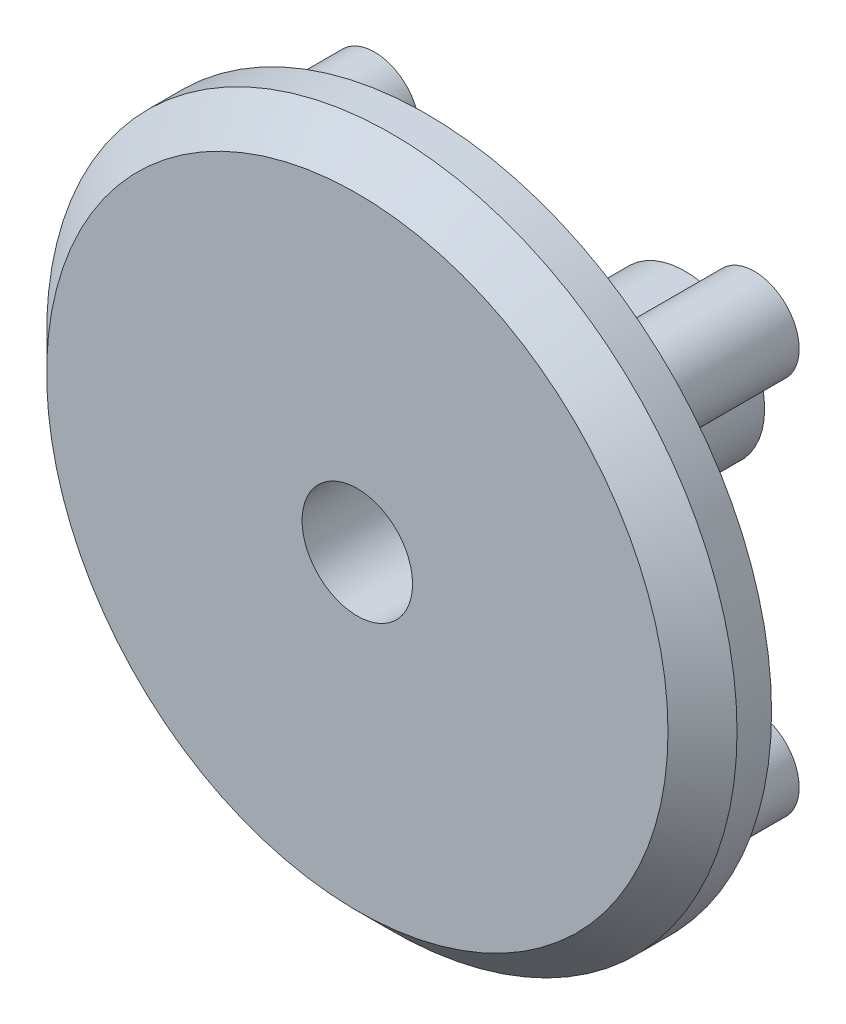
ISO-10303-21;
HEADER;
FILE_DESCRIPTION(('STEP AP214'),'2;1');
FILE_NAME('part.step','',(''),(''),'','','');
FILE_SCHEMA(('AUTOMOTIVE_DESIGN { 1 0 10303 214 1 1 1 1 }'));
ENDSEC;
DATA;
#1=APPLICATION_CONTEXT('core data for automotive mechanical design processes');
#2=APPLICATION_PROTOCOL_DEFINITION('international standard','automotive_design',2000,#1);
#3=PRODUCT_CONTEXT('',#1,'mechanical');
#4=PRODUCT('Part','Part','',(#3));
#5=PRODUCT_RELATED_PRODUCT_CATEGORY('part','',(#4));
#6=PRODUCT_DEFINITION_FORMATION('','',#4);
#7=PRODUCT_DEFINITION_CONTEXT('part definition',#1,'design');
#8=PRODUCT_DEFINITION('design','',#6,#7);
#9=PRODUCT_DEFINITION_SHAPE('','',#8);
#10=(LENGTH_UNIT() NAMED_UNIT(*) SI_UNIT(.MILLI.,.METRE.));
#11=(NAMED_UNIT(*) PLANE_ANGLE_UNIT() SI_UNIT($,.RADIAN.));
#12=(NAMED_UNIT(*) SI_UNIT($,.STERADIAN.) SOLID_ANGLE_UNIT());
#13=UNCERTAINTY_MEASURE_WITH_UNIT(LENGTH_MEASURE(1.E-05),#10,'distance_accuracy_value','');
#14=(GEOMETRIC_REPRESENTATION_CONTEXT(3) GLOBAL_UNCERTAINTY_ASSIGNED_CONTEXT((#13)) GLOBAL_UNIT_ASSIGNED_CONTEXT((#10,
#11,#12)) REPRESENTATION_CONTEXT('',''));
#15=CARTESIAN_POINT('',(0.,0.,0.));
#16=DIRECTION('',(0.,0.,1.));
#17=DIRECTION('',(1.,0.,0.));
#18=AXIS2_PLACEMENT_3D('',#15,#16,#17);
#19=CARTESIAN_POINT('',(0.,0.,2.));
#20=DIRECTION('',(0.,0.,1.));
#21=DIRECTION('',(1.,0.,0.));
#22=AXIS2_PLACEMENT_3D('',#19,#20,#21);
#23=PLANE('',#22);
#24=CARTESIAN_POINT('',(0.,0.,2.));
#25=DIRECTION('',(0.,0.,1.));
#26=DIRECTION('',(1.,0.,0.));
#27=AXIS2_PLACEMENT_3D('',#24,#25,#26);
#28=CIRCLE('',#27,9.00000000000001);
#29=CARTESIAN_POINT('',(9.00000000000001,0.,2.));
#30=VERTEX_POINT('',#29);
#31=EDGE_CURVE('E59',#30,#30,#28,.T.);
#32=ORIENTED_EDGE('',*,*,#31,.T.);
#33=EDGE_LOOP('',(#32));
#34=FACE_BOUND('',#33,.T.);
#35=CARTESIAN_POINT('',(0.,0.,2.));
#36=DIRECTION('',(0.,0.,1.));
#37=DIRECTION('',(1.,0.,0.));
#38=AXIS2_PLACEMENT_3D('',#35,#36,#37);
#39=CIRCLE('',#38,1.6);
#40=CARTESIAN_POINT('',(1.6,0.,2.));
#41=VERTEX_POINT('',#40);
#42=EDGE_CURVE('E67',#41,#41,#39,.T.);
#43=ORIENTED_EDGE('',*,*,#42,.F.);
#44=EDGE_LOOP('',(#43));
#45=FACE_BOUND('',#44,.T.);
#46=ADVANCED_FACE('F51',(#34,#45),#23,.T.);
#47=CARTESIAN_POINT('',(0.,0.,0.));
#48=DIRECTION('',(0.,0.,1.));
#49=DIRECTION('',(1.,0.,0.));
#50=AXIS2_PLACEMENT_3D('',#47,#48,#49);
#51=PLANE('',#50);
#52=CARTESIAN_POINT('',(0.,0.,0.));
#53=DIRECTION('',(0.,0.,1.));
#54=DIRECTION('',(1.,0.,0.));
#55=AXIS2_PLACEMENT_3D('',#52,#53,#54);
#56=CIRCLE('',#55,2.3);
#57=CARTESIAN_POINT('',(2.3,0.,0.));
#58=VERTEX_POINT('',#57);
#59=EDGE_CURVE('E97',#58,#58,#56,.T.);
#60=ORIENTED_EDGE('',*,*,#59,.T.);
#61=EDGE_LOOP('',(#60));
#62=FACE_BOUND('',#61,.T.);
#63=CARTESIAN_POINT('',(-5.5,-5.5,0.));
#64=DIRECTION('',(0.,0.,1.));
#65=DIRECTION('',(1.,0.,0.));
#66=AXIS2_PLACEMENT_3D('',#63,#64,#65);
#67=CIRCLE('',#66,1.3);
#68=CARTESIAN_POINT('',(-4.2,-5.5,0.));
#69=VERTEX_POINT('',#68);
#70=EDGE_CURVE('E91',#69,#69,#67,.T.);
#71=ORIENTED_EDGE('',*,*,#70,.T.);
#72=EDGE_LOOP('',(#71));
#73=FACE_BOUND('',#72,.T.);
#74=CARTESIAN_POINT('',(5.5,-5.5,0.));
#75=DIRECTION('',(0.,0.,1.));
#76=DIRECTION('',(1.,0.,0.));
#77=AXIS2_PLACEMENT_3D('',#74,#75,#76);
#78=CIRCLE('',#77,1.3);
#79=CARTESIAN_POINT('',(6.8,-5.5,0.));
#80=VERTEX_POINT('',#79);
#81=EDGE_CURVE('E85',#80,#80,#78,.T.);
#82=ORIENTED_EDGE('',*,*,#81,.T.);
#83=EDGE_LOOP('',(#82));
#84=FACE_BOUND('',#83,.T.);
#85=CARTESIAN_POINT('',(5.5,5.5,0.));
#86=DIRECTION('',(0.,0.,1.));
#87=DIRECTION('',(1.,0.,0.));
#88=AXIS2_PLACEMENT_3D('',#85,#86,#87);
#89=CIRCLE('',#88,1.3);
#90=CARTESIAN_POINT('',(6.8,5.5,0.));
#91=VERTEX_POINT('',#90);
#92=EDGE_CURVE('E79',#91,#91,#89,.T.);
#93=ORIENTED_EDGE('',*,*,#92,.T.);
#94=EDGE_LOOP('',(#93));
#95=FACE_BOUND('',#94,.T.);
#96=CARTESIAN_POINT('',(-5.5,5.5,0.));
#97=DIRECTION('',(0.,0.,1.));
#98=DIRECTION('',(1.,0.,0.));
#99=AXIS2_PLACEMENT_3D('',#96,#97,#98);
#100=CIRCLE('',#99,1.3);
#101=CARTESIAN_POINT('',(-4.2,5.5,0.));
#102=VERTEX_POINT('',#101);
#103=EDGE_CURVE('E73',#102,#102,#100,.T.);
#104=ORIENTED_EDGE('',*,*,#103,.T.);
#105=EDGE_LOOP('',(#104));
#106=FACE_BOUND('',#105,.T.);
#107=CARTESIAN_POINT('',(0.,0.,0.));
#108=DIRECTION('',(0.,0.,1.));
#109=DIRECTION('',(1.,0.,0.));
#110=AXIS2_PLACEMENT_3D('',#107,#108,#109);
#111=CIRCLE('',#110,10.);
#112=CARTESIAN_POINT('',(9.99999999999999,0.,0.));
#113=VERTEX_POINT('',#112);
#114=EDGE_CURVE('E63',#113,#113,#111,.T.);
#115=ORIENTED_EDGE('',*,*,#114,.F.);
#116=EDGE_LOOP('',(#115));
#117=FACE_BOUND('',#116,.T.);
#118=ADVANCED_FACE('F124',(#62,#73,#84,#95,#106,#117),#51,.F.);
#119=CARTESIAN_POINT('',(0.,0.,2.));
#120=DIRECTION('',(0.,0.,-1.));
#121=DIRECTION('',(-1.,0.,0.));
#122=AXIS2_PLACEMENT_3D('',#119,#120,#121);
#123=CYLINDRICAL_SURFACE('',#122,10.);
#124=CARTESIAN_POINT('',(0.,0.,1.));
#125=DIRECTION('',(0.,0.,1.));
#126=DIRECTION('',(1.,0.,0.));
#127=AXIS2_PLACEMENT_3D('',#124,#125,#126);
#128=CIRCLE('',#127,10.);
#129=CARTESIAN_POINT('',(9.99999999999999,0.,1.));
#130=VERTEX_POINT('',#129);
#131=EDGE_CURVE('E11',#130,#130,#128,.F.);
#132=ORIENTED_EDGE('',*,*,#131,.T.);
#133=EDGE_LOOP('',(#132));
#134=FACE_BOUND('',#133,.T.);
#135=ORIENTED_EDGE('',*,*,#114,.T.);
#136=EDGE_LOOP('',(#135));
#137=FACE_BOUND('',#136,.T.);
#138=ADVANCED_FACE('F112',(#134,#137),#123,.T.);
#139=CARTESIAN_POINT('',(0.,0.,2.));
#140=DIRECTION('',(0.,0.,-1.));
#141=DIRECTION('',(-1.,0.,0.));
#142=AXIS2_PLACEMENT_3D('',#139,#140,#141);
#143=CYLINDRICAL_SURFACE('',#142,1.6);
#144=ORIENTED_EDGE('',*,*,#42,.T.);
#145=EDGE_LOOP('',(#144));
#146=FACE_BOUND('',#145,.T.);
#147=CARTESIAN_POINT('',(0.,0.,-7.5));
#148=DIRECTION('',(0.,0.,1.));
#149=DIRECTION('',(1.,0.,0.));
#150=AXIS2_PLACEMENT_3D('',#147,#148,#149);
#151=CIRCLE('',#150,1.6);
#152=CARTESIAN_POINT('',(1.6,0.,-7.5));
#153=VERTEX_POINT('',#152);
#154=EDGE_CURVE('E100',#153,#153,#151,.T.);
#155=ORIENTED_EDGE('',*,*,#154,.F.);
#156=EDGE_LOOP('',(#155));
#157=FACE_BOUND('',#156,.T.);
#158=ADVANCED_FACE('F109',(#146,#157),#143,.F.);
#159=CARTESIAN_POINT('',(-5.5,5.5,-4.));
#160=DIRECTION('',(0.,0.,1.));
#161=DIRECTION('',(1.,0.,0.));
#162=AXIS2_PLACEMENT_3D('',#159,#160,#161);
#163=CYLINDRICAL_SURFACE('',#162,1.3);
#164=CARTESIAN_POINT('',(-5.5,5.5,-4.));
#165=DIRECTION('',(0.,0.,1.));
#166=DIRECTION('',(1.,0.,0.));
#167=AXIS2_PLACEMENT_3D('',#164,#165,#166);
#168=CIRCLE('',#167,1.3);
#169=CARTESIAN_POINT('',(-4.2,5.5,-4.));
#170=VERTEX_POINT('',#169);
#171=EDGE_CURVE('E72',#170,#170,#168,.T.);
#172=ORIENTED_EDGE('',*,*,#171,.T.);
#173=EDGE_LOOP('',(#172));
#174=FACE_BOUND('',#173,.T.);
#175=ORIENTED_EDGE('',*,*,#103,.F.);
#176=EDGE_LOOP('',(#175));
#177=FACE_BOUND('',#176,.T.);
#178=ADVANCED_FACE('F111',(#174,#177),#163,.T.);
#179=CARTESIAN_POINT('',(0.,0.,-4.));
#180=DIRECTION('',(0.,0.,1.));
#181=DIRECTION('',(1.,0.,0.));
#182=AXIS2_PLACEMENT_3D('',#179,#180,#181);
#183=PLANE('',#182);
#184=ORIENTED_EDGE('',*,*,#171,.F.);
#185=EDGE_LOOP('',(#184));
#186=FACE_BOUND('',#185,.T.);
#187=ADVANCED_FACE('F120',(#186),#183,.F.);
#188=CARTESIAN_POINT('',(5.5,5.5,-4.));
#189=DIRECTION('',(0.,0.,1.));
#190=DIRECTION('',(1.,0.,0.));
#191=AXIS2_PLACEMENT_3D('',#188,#189,#190);
#192=CYLINDRICAL_SURFACE('',#191,1.3);
#193=CARTESIAN_POINT('',(5.5,5.5,-4.));
#194=DIRECTION('',(0.,0.,1.));
#195=DIRECTION('',(1.,0.,0.));
#196=AXIS2_PLACEMENT_3D('',#193,#194,#195);
#197=CIRCLE('',#196,1.3);
#198=CARTESIAN_POINT('',(6.8,5.5,-4.));
#199=VERTEX_POINT('',#198);
#200=EDGE_CURVE('E76',#199,#199,#197,.T.);
#201=ORIENTED_EDGE('',*,*,#200,.T.);
#202=EDGE_LOOP('',(#201));
#203=FACE_BOUND('',#202,.T.);
#204=ORIENTED_EDGE('',*,*,#92,.F.);
#205=EDGE_LOOP('',(#204));
#206=FACE_BOUND('',#205,.T.);
#207=ADVANCED_FACE('F151',(#203,#206),#192,.T.);
#208=CARTESIAN_POINT('',(0.,0.,-4.));
#209=DIRECTION('',(0.,0.,1.));
#210=DIRECTION('',(1.,0.,0.));
#211=AXIS2_PLACEMENT_3D('',#208,#209,#210);
#212=PLANE('',#211);
#213=ORIENTED_EDGE('',*,*,#200,.F.);
#214=EDGE_LOOP('',(#213));
#215=FACE_BOUND('',#214,.T.);
#216=ADVANCED_FACE('F153',(#215),#212,.F.);
#217=CARTESIAN_POINT('',(5.5,-5.5,-4.));
#218=DIRECTION('',(0.,0.,1.));
#219=DIRECTION('',(1.,0.,0.));
#220=AXIS2_PLACEMENT_3D('',#217,#218,#219);
#221=CYLINDRICAL_SURFACE('',#220,1.3);
#222=CARTESIAN_POINT('',(5.5,-5.5,-4.));
#223=DIRECTION('',(0.,0.,1.));
#224=DIRECTION('',(1.,0.,0.));
#225=AXIS2_PLACEMENT_3D('',#222,#223,#224);
#226=CIRCLE('',#225,1.3);
#227=CARTESIAN_POINT('',(6.8,-5.5,-4.));
#228=VERTEX_POINT('',#227);
#229=EDGE_CURVE('E82',#228,#228,#226,.T.);
#230=ORIENTED_EDGE('',*,*,#229,.T.);
#231=EDGE_LOOP('',(#230));
#232=FACE_BOUND('',#231,.T.);
#233=ORIENTED_EDGE('',*,*,#81,.F.);
#234=EDGE_LOOP('',(#233));
#235=FACE_BOUND('',#234,.T.);
#236=ADVANCED_FACE('F160',(#232,#235),#221,.T.);
#237=CARTESIAN_POINT('',(0.,0.,-4.));
#238=DIRECTION('',(0.,0.,1.));
#239=DIRECTION('',(1.,0.,0.));
#240=AXIS2_PLACEMENT_3D('',#237,#238,#239);
#241=PLANE('',#240);
#242=ORIENTED_EDGE('',*,*,#229,.F.);
#243=EDGE_LOOP('',(#242));
#244=FACE_BOUND('',#243,.T.);
#245=ADVANCED_FACE('F168',(#244),#241,.F.);
#246=CARTESIAN_POINT('',(-5.5,-5.5,-4.));
#247=DIRECTION('',(0.,0.,1.));
#248=DIRECTION('',(1.,0.,0.));
#249=AXIS2_PLACEMENT_3D('',#246,#247,#248);
#250=CYLINDRICAL_SURFACE('',#249,1.3);
#251=CARTESIAN_POINT('',(-5.5,-5.5,-4.));
#252=DIRECTION('',(0.,0.,1.));
#253=DIRECTION('',(1.,0.,0.));
#254=AXIS2_PLACEMENT_3D('',#251,#252,#253);
#255=CIRCLE('',#254,1.3);
#256=CARTESIAN_POINT('',(-4.2,-5.5,-4.));
#257=VERTEX_POINT('',#256);
#258=EDGE_CURVE('E88',#257,#257,#255,.T.);
#259=ORIENTED_EDGE('',*,*,#258,.T.);
#260=EDGE_LOOP('',(#259));
#261=FACE_BOUND('',#260,.T.);
#262=ORIENTED_EDGE('',*,*,#70,.F.);
#263=EDGE_LOOP('',(#262));
#264=FACE_BOUND('',#263,.T.);
#265=ADVANCED_FACE('F172',(#261,#264),#250,.T.);
#266=CARTESIAN_POINT('',(0.,0.,-4.));
#267=DIRECTION('',(0.,0.,1.));
#268=DIRECTION('',(1.,0.,0.));
#269=AXIS2_PLACEMENT_3D('',#266,#267,#268);
#270=PLANE('',#269);
#271=ORIENTED_EDGE('',*,*,#258,.F.);
#272=EDGE_LOOP('',(#271));
#273=FACE_BOUND('',#272,.T.);
#274=ADVANCED_FACE('F176',(#273),#270,.F.);
#275=CARTESIAN_POINT('',(0.,0.,2.));
#276=DIRECTION('',(0.,0.,-1.));
#277=DIRECTION('',(-1.,0.,0.));
#278=AXIS2_PLACEMENT_3D('',#275,#276,#277);
#279=CONICAL_SURFACE('',#278,9.00000000000001,0.785398163397447);
#280=ORIENTED_EDGE('',*,*,#131,.F.);
#281=EDGE_LOOP('',(#280));
#282=FACE_BOUND('',#281,.T.);
#283=ORIENTED_EDGE('',*,*,#31,.F.);
#284=EDGE_LOOP('',(#283));
#285=FACE_BOUND('',#284,.T.);
#286=ADVANCED_FACE('F54',(#282,#285),#279,.T.);
#287=CARTESIAN_POINT('',(0.,0.,-7.5));
#288=DIRECTION('',(0.,0.,1.));
#289=DIRECTION('',(1.,0.,0.));
#290=AXIS2_PLACEMENT_3D('',#287,#288,#289);
#291=CYLINDRICAL_SURFACE('',#290,2.3);
#292=CARTESIAN_POINT('',(0.,0.,-7.5));
#293=DIRECTION('',(0.,0.,1.));
#294=DIRECTION('',(1.,0.,0.));
#295=AXIS2_PLACEMENT_3D('',#292,#293,#294);
#296=CIRCLE('',#295,2.3);
#297=CARTESIAN_POINT('',(2.3,0.,-7.5));
#298=VERTEX_POINT('',#297);
#299=EDGE_CURVE('E94',#298,#298,#296,.T.);
#300=ORIENTED_EDGE('',*,*,#299,.T.);
#301=EDGE_LOOP('',(#300));
#302=FACE_BOUND('',#301,.T.);
#303=ORIENTED_EDGE('',*,*,#59,.F.);
#304=EDGE_LOOP('',(#303));
#305=FACE_BOUND('',#304,.T.);
#306=ADVANCED_FACE('F180',(#302,#305),#291,.T.);
#307=CARTESIAN_POINT('',(0.,0.,-7.5));
#308=DIRECTION('',(0.,0.,1.));
#309=DIRECTION('',(1.,0.,0.));
#310=AXIS2_PLACEMENT_3D('',#307,#308,#309);
#311=PLANE('',#310);
#312=ORIENTED_EDGE('',*,*,#154,.T.);
#313=EDGE_LOOP('',(#312));
#314=FACE_BOUND('',#313,.T.);
#315=ORIENTED_EDGE('',*,*,#299,.F.);
#316=EDGE_LOOP('',(#315));
#317=FACE_BOUND('',#316,.T.);
#318=ADVANCED_FACE('F106',(#314,#317),#311,.F.);
#319=CLOSED_SHELL('',(#46,#118,#138,#158,#178,#187,#207,#216,#236,#245,#265,#274,#286,#306,#318));
#320=MANIFOLD_SOLID_BREP('B2',#319);
#321=ADVANCED_BREP_SHAPE_REPRESENTATION('',(#18,#320),#14);
#322=SHAPE_DEFINITION_REPRESENTATION(#9,#321);
ENDSEC;
END-ISO-10303-21;
